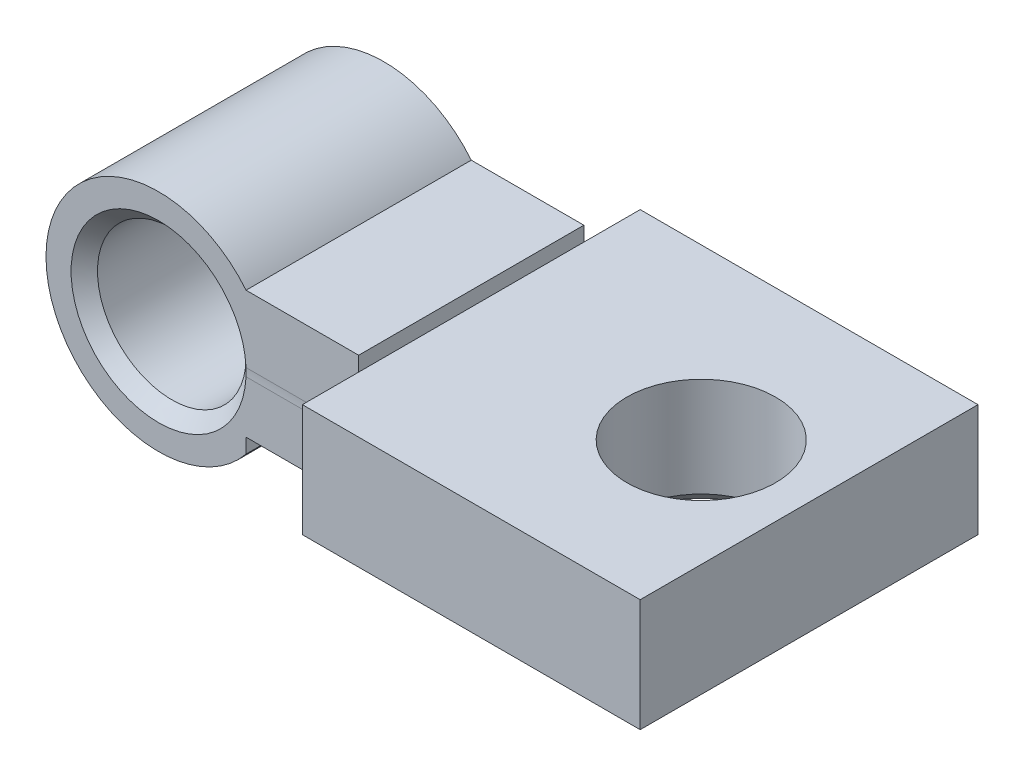
ISO-10303-21;
HEADER;
FILE_DESCRIPTION(('STEP AP214'),'2;1');
FILE_NAME('part.step','',(''),(''),'','','');
FILE_SCHEMA(('AUTOMOTIVE_DESIGN { 1 0 10303 214 1 1 1 1 }'));
ENDSEC;
DATA;
#1=APPLICATION_CONTEXT('core data for automotive mechanical design processes');
#2=APPLICATION_PROTOCOL_DEFINITION('international standard','automotive_design',2000,#1);
#3=PRODUCT_CONTEXT('',#1,'mechanical');
#4=PRODUCT('Part','Part','',(#3));
#5=PRODUCT_RELATED_PRODUCT_CATEGORY('part','',(#4));
#6=PRODUCT_DEFINITION_FORMATION('','',#4);
#7=PRODUCT_DEFINITION_CONTEXT('part definition',#1,'design');
#8=PRODUCT_DEFINITION('design','',#6,#7);
#9=PRODUCT_DEFINITION_SHAPE('','',#8);
#10=(LENGTH_UNIT() NAMED_UNIT(*) SI_UNIT(.MILLI.,.METRE.));
#11=(NAMED_UNIT(*) PLANE_ANGLE_UNIT() SI_UNIT($,.RADIAN.));
#12=(NAMED_UNIT(*) SI_UNIT($,.STERADIAN.) SOLID_ANGLE_UNIT());
#13=UNCERTAINTY_MEASURE_WITH_UNIT(LENGTH_MEASURE(1.E-05),#10,'distance_accuracy_value','');
#14=(GEOMETRIC_REPRESENTATION_CONTEXT(3) GLOBAL_UNCERTAINTY_ASSIGNED_CONTEXT((#13)) GLOBAL_UNIT_ASSIGNED_CONTEXT((#10,
#11,#12)) REPRESENTATION_CONTEXT('',''));
#15=CARTESIAN_POINT('',(0.,0.,0.));
#16=DIRECTION('',(0.,0.,1.));
#17=DIRECTION('',(1.,0.,0.));
#18=AXIS2_PLACEMENT_3D('',#15,#16,#17);
#19=CARTESIAN_POINT('',(3.88246984652232,-6.09266151445271,0.));
#20=DIRECTION('',(-1.,0.,0.));
#21=DIRECTION('',(0.,0.,1.));
#22=AXIS2_PLACEMENT_3D('',#19,#20,#21);
#23=PLANE('',#22);
#24=DIRECTION('',(0.,0.,-1.));
#25=VECTOR('',#24,1.);
#26=CARTESIAN_POINT('',(3.88246984652232,-2.5,0.));
#27=LINE('',#26,#25);
#28=CARTESIAN_POINT('',(3.88246984652232,-2.5,10.));
#29=VERTEX_POINT('',#28);
#30=CARTESIAN_POINT('',(3.88246984652232,-2.5,0.));
#31=VERTEX_POINT('',#30);
#32=EDGE_CURVE('E68',#29,#31,#27,.T.);
#33=ORIENTED_EDGE('',*,*,#32,.F.);
#34=DIRECTION('',(0.,-1.,0.));
#35=VECTOR('',#34,1.);
#36=CARTESIAN_POINT('',(3.88246984652232,-6.09266151445271,10.));
#37=LINE('',#36,#35);
#38=CARTESIAN_POINT('',(3.88246984652232,-3.1506234130478,10.));
#39=VERTEX_POINT('',#38);
#40=EDGE_CURVE('E251',#29,#39,#37,.T.);
#41=ORIENTED_EDGE('',*,*,#40,.T.);
#42=DIRECTION('',(0.,0.,-1.));
#43=VECTOR('',#42,1.);
#44=CARTESIAN_POINT('',(3.88246984652232,-3.1506234130478,10.));
#45=LINE('',#44,#43);
#46=CARTESIAN_POINT('',(3.88246984652232,-3.1506234130478,0.));
#47=VERTEX_POINT('',#46);
#48=EDGE_CURVE('E287',#47,#39,#45,.F.);
#49=ORIENTED_EDGE('',*,*,#48,.F.);
#50=DIRECTION('',(0.,-1.,0.));
#51=VECTOR('',#50,1.);
#52=CARTESIAN_POINT('',(3.88246984652232,-6.09266151445271,0.));
#53=LINE('',#52,#51);
#54=EDGE_CURVE('E274',#31,#47,#53,.T.);
#55=ORIENTED_EDGE('',*,*,#54,.F.);
#56=EDGE_LOOP('',(#33,#41,#49,#55));
#57=FACE_BOUND('',#56,.T.);
#58=ADVANCED_FACE('F42',(#57),#23,.F.);
#59=CARTESIAN_POINT('',(0.,0.,10.));
#60=DIRECTION('',(0.,0.,-1.));
#61=DIRECTION('',(-1.,0.,0.));
#62=AXIS2_PLACEMENT_3D('',#59,#60,#61);
#63=CYLINDRICAL_SURFACE('',#62,5.);
#64=CARTESIAN_POINT('',(0.,0.,0.));
#65=DIRECTION('',(0.,0.,1.));
#66=DIRECTION('',(1.,0.,0.));
#67=AXIS2_PLACEMENT_3D('',#64,#65,#66);
#68=CIRCLE('',#67,5.);
#69=CARTESIAN_POINT('',(3.88246984652232,3.1506234130478,0.));
#70=VERTEX_POINT('',#69);
#71=EDGE_CURVE('E301',#70,#47,#68,.T.);
#72=ORIENTED_EDGE('',*,*,#71,.T.);
#73=ORIENTED_EDGE('',*,*,#48,.T.);
#74=CARTESIAN_POINT('',(0.,0.,10.));
#75=DIRECTION('',(0.,0.,1.));
#76=DIRECTION('',(1.,0.,0.));
#77=AXIS2_PLACEMENT_3D('',#74,#75,#76);
#78=CIRCLE('',#77,5.);
#79=CARTESIAN_POINT('',(3.88246984652232,3.1506234130478,10.));
#80=VERTEX_POINT('',#79);
#81=EDGE_CURVE('E52',#80,#39,#78,.T.);
#82=ORIENTED_EDGE('',*,*,#81,.F.);
#83=DIRECTION('',(0.,0.,1.));
#84=VECTOR('',#83,1.);
#85=CARTESIAN_POINT('',(3.88246984652232,3.1506234130478,0.));
#86=LINE('',#85,#84);
#87=EDGE_CURVE('E283',#70,#80,#86,.T.);
#88=ORIENTED_EDGE('',*,*,#87,.F.);
#89=EDGE_LOOP('',(#72,#73,#82,#88));
#90=FACE_BOUND('',#89,.T.);
#91=ADVANCED_FACE('F44',(#90),#63,.T.);
#92=CARTESIAN_POINT('',(0.,0.,10.));
#93=DIRECTION('',(0.,0.,1.));
#94=DIRECTION('',(1.,0.,0.));
#95=AXIS2_PLACEMENT_3D('',#92,#93,#94);
#96=PLANE('',#95);
#97=CARTESIAN_POINT('',(0.,0.,10.));
#98=DIRECTION('',(0.,0.,1.));
#99=DIRECTION('',(1.,0.,0.));
#100=AXIS2_PLACEMENT_3D('',#97,#98,#99);
#101=CIRCLE('',#100,3.8865);
#102=CARTESIAN_POINT('',(3.88246984652232,0.176946717530785,10.));
#103=VERTEX_POINT('',#102);
#104=CARTESIAN_POINT('',(3.88246984652232,-0.176946717530785,10.));
#105=VERTEX_POINT('',#104);
#106=EDGE_CURVE('E297',#103,#105,#101,.T.);
#107=ORIENTED_EDGE('',*,*,#106,.F.);
#108=DIRECTION('',(-1.,0.,0.));
#109=VECTOR('',#108,1.);
#110=CARTESIAN_POINT('',(8.88246984652232,0.176946717530788,9.99999999999999));
#111=LINE('',#110,#109);
#112=CARTESIAN_POINT('',(8.88246984652232,0.176946717530788,9.99999999999999));
#113=VERTEX_POINT('',#112);
#114=EDGE_CURVE('E247',#113,#103,#111,.T.);
#115=ORIENTED_EDGE('',*,*,#114,.F.);
#116=DIRECTION('',(0.,-1.,0.));
#117=VECTOR('',#116,1.);
#118=CARTESIAN_POINT('',(8.88246984652232,0.,10.));
#119=LINE('',#118,#117);
#120=CARTESIAN_POINT('',(8.88246984652232,2.5,10.));
#121=VERTEX_POINT('',#120);
#122=EDGE_CURVE('E264',#121,#113,#119,.T.);
#123=ORIENTED_EDGE('',*,*,#122,.F.);
#124=CARTESIAN_POINT('',(8.88246984652232,3.1506234130478,10.));
#125=VERTEX_POINT('',#124);
#126=EDGE_CURVE('E256',#125,#121,#119,.T.);
#127=ORIENTED_EDGE('',*,*,#126,.F.);
#128=DIRECTION('',(-1.,0.,0.));
#129=VECTOR('',#128,1.);
#130=CARTESIAN_POINT('',(8.88246984652232,3.1506234130478,10.));
#131=LINE('',#130,#129);
#132=EDGE_CURVE('E242',#125,#80,#131,.T.);
#133=ORIENTED_EDGE('',*,*,#132,.T.);
#134=ORIENTED_EDGE('',*,*,#81,.T.);
#135=ORIENTED_EDGE('',*,*,#40,.F.);
#136=DIRECTION('',(-1.,0.,0.));
#137=VECTOR('',#136,1.);
#138=CARTESIAN_POINT('',(8.88246984652232,-2.5,10.));
#139=LINE('',#138,#137);
#140=CARTESIAN_POINT('',(8.88246984652232,-2.5,10.));
#141=VERTEX_POINT('',#140);
#142=EDGE_CURVE('E236',#141,#29,#139,.T.);
#143=ORIENTED_EDGE('',*,*,#142,.F.);
#144=DIRECTION('',(0.,-1.,0.));
#145=VECTOR('',#144,1.);
#146=CARTESIAN_POINT('',(8.88246984652232,0.,10.));
#147=LINE('',#146,#145);
#148=CARTESIAN_POINT('',(8.88246984652232,-0.176946717530786,10.));
#149=VERTEX_POINT('',#148);
#150=EDGE_CURVE('E237',#149,#141,#147,.T.);
#151=ORIENTED_EDGE('',*,*,#150,.F.);
#152=DIRECTION('',(-1.,0.,0.));
#153=VECTOR('',#152,1.);
#154=CARTESIAN_POINT('',(8.88246984652232,-0.176946717530786,10.));
#155=LINE('',#154,#153);
#156=EDGE_CURVE('E241',#149,#105,#155,.T.);
#157=ORIENTED_EDGE('',*,*,#156,.T.);
#158=EDGE_LOOP('',(#107,#115,#123,#127,#133,#134,#135,#143,#151,#157));
#159=FACE_BOUND('',#158,.T.);
#160=ADVANCED_FACE('F319',(#159),#96,.T.);
#161=CARTESIAN_POINT('',(0.,0.,0.));
#162=DIRECTION('',(0.,0.,1.));
#163=DIRECTION('',(1.,0.,0.));
#164=AXIS2_PLACEMENT_3D('',#161,#162,#163);
#165=PLANE('',#164);
#166=CARTESIAN_POINT('',(0.,0.,0.));
#167=DIRECTION('',(0.,0.,1.));
#168=DIRECTION('',(1.,0.,0.));
#169=AXIS2_PLACEMENT_3D('',#166,#167,#168);
#170=CIRCLE('',#169,3.29999999999999);
#171=CARTESIAN_POINT('',(3.29999999999999,0.,0.));
#172=VERTEX_POINT('',#171);
#173=EDGE_CURVE('E296',#172,#172,#170,.T.);
#174=ORIENTED_EDGE('',*,*,#173,.T.);
#175=EDGE_LOOP('',(#174));
#176=FACE_BOUND('',#175,.T.);
#177=ORIENTED_EDGE('',*,*,#71,.F.);
#178=DIRECTION('',(-1.,0.,0.));
#179=VECTOR('',#178,1.);
#180=CARTESIAN_POINT('',(8.88246984652232,3.1506234130478,0.));
#181=LINE('',#180,#179);
#182=CARTESIAN_POINT('',(8.88246984652232,3.1506234130478,0.));
#183=VERTEX_POINT('',#182);
#184=EDGE_CURVE('E246',#183,#70,#181,.T.);
#185=ORIENTED_EDGE('',*,*,#184,.F.);
#186=DIRECTION('',(0.,1.,0.));
#187=VECTOR('',#186,1.);
#188=CARTESIAN_POINT('',(8.88246984652232,0.,0.));
#189=LINE('',#188,#187);
#190=CARTESIAN_POINT('',(8.88246984652232,2.5,0.));
#191=VERTEX_POINT('',#190);
#192=EDGE_CURVE('E166',#191,#183,#189,.T.);
#193=ORIENTED_EDGE('',*,*,#192,.F.);
#194=CARTESIAN_POINT('',(8.88246984652232,-2.5,0.));
#195=VERTEX_POINT('',#194);
#196=EDGE_CURVE('E183',#195,#191,#189,.T.);
#197=ORIENTED_EDGE('',*,*,#196,.F.);
#198=DIRECTION('',(-1.,0.,0.));
#199=VECTOR('',#198,1.);
#200=CARTESIAN_POINT('',(8.88246984652232,-2.5,0.));
#201=LINE('',#200,#199);
#202=EDGE_CURVE('E232',#195,#31,#201,.T.);
#203=ORIENTED_EDGE('',*,*,#202,.T.);
#204=ORIENTED_EDGE('',*,*,#54,.T.);
#205=EDGE_LOOP('',(#177,#185,#193,#197,#203,#204));
#206=FACE_BOUND('',#205,.T.);
#207=ADVANCED_FACE('F354',(#176,#206),#165,.F.);
#208=CARTESIAN_POINT('',(0.,0.,10.));
#209=DIRECTION('',(0.,0.,1.));
#210=DIRECTION('',(1.,0.,0.));
#211=AXIS2_PLACEMENT_3D('',#208,#209,#210);
#212=CYLINDRICAL_SURFACE('',#211,3.29999999999999);
#213=CARTESIAN_POINT('',(0.,0.,9.41349999999998));
#214=DIRECTION('',(0.,0.,1.));
#215=DIRECTION('',(1.,0.,0.));
#216=AXIS2_PLACEMENT_3D('',#213,#214,#215);
#217=CIRCLE('',#216,3.29999999999999);
#218=CARTESIAN_POINT('',(3.29999999999999,0.,9.41349999999998));
#219=VERTEX_POINT('',#218);
#220=EDGE_CURVE('E292',#219,#219,#217,.T.);
#221=ORIENTED_EDGE('',*,*,#220,.T.);
#222=EDGE_LOOP('',(#221));
#223=FACE_BOUND('',#222,.T.);
#224=ORIENTED_EDGE('',*,*,#173,.F.);
#225=EDGE_LOOP('',(#224));
#226=FACE_BOUND('',#225,.T.);
#227=ADVANCED_FACE('F406',(#223,#226),#212,.F.);
#228=CARTESIAN_POINT('',(0.,0.,10.));
#229=DIRECTION('',(0.,0.,1.));
#230=DIRECTION('',(1.,0.,0.));
#231=AXIS2_PLACEMENT_3D('',#228,#229,#230);
#232=CONICAL_SURFACE('',#231,3.8865,0.785398163397441);
#233=ORIENTED_EDGE('',*,*,#220,.F.);
#234=EDGE_LOOP('',(#233));
#235=FACE_BOUND('',#234,.T.);
#236=ORIENTED_EDGE('',*,*,#106,.T.);
#237=CARTESIAN_POINT('',(3.88246984652232,0.176946717530788,9.99999999999999));
#238=CARTESIAN_POINT('',(3.88246984652232,0.,9.99194387216134));
#239=CARTESIAN_POINT('',(3.88246984652232,-0.176946717530786,9.99999999999999));
#240=B_SPLINE_CURVE_WITH_KNOTS('',2,(#237,#238,#239),.UNSPECIFIED.,.F.,.F.,(3,3),(0.,1.),.UNSPECIFIED.);
#241=EDGE_CURVE('E291',#105,#103,#240,.F.);
#242=ORIENTED_EDGE('',*,*,#241,.T.);
#243=EDGE_LOOP('',(#236,#242));
#244=FACE_BOUND('',#243,.T.);
#245=ADVANCED_FACE('F314',(#235,#244),#232,.F.);
#246=CARTESIAN_POINT('',(8.88246984652232,3.1506234130478,0.));
#247=DIRECTION('',(0.,-1.,0.));
#248=DIRECTION('',(0.,0.,-1.));
#249=AXIS2_PLACEMENT_3D('',#246,#247,#248);
#250=PLANE('',#249);
#251=ORIENTED_EDGE('',*,*,#87,.T.);
#252=ORIENTED_EDGE('',*,*,#132,.F.);
#253=DIRECTION('',(0.,0.,1.));
#254=VECTOR('',#253,1.);
#255=CARTESIAN_POINT('',(8.88246984652232,3.1506234130478,0.));
#256=LINE('',#255,#254);
#257=EDGE_CURVE('E227',#183,#125,#256,.T.);
#258=ORIENTED_EDGE('',*,*,#257,.F.);
#259=ORIENTED_EDGE('',*,*,#184,.T.);
#260=EDGE_LOOP('',(#251,#252,#258,#259));
#261=FACE_BOUND('',#260,.T.);
#262=ADVANCED_FACE('F219',(#261),#250,.F.);
#263=CARTESIAN_POINT('',(8.88246984652232,0.176946717530788,9.99999999999999));
#264=CARTESIAN_POINT('',(8.88246984652232,0.,9.99194387216134));
#265=CARTESIAN_POINT('',(8.88246984652232,-0.176946717530786,9.99999999999999));
#266=B_SPLINE_CURVE_WITH_KNOTS('',2,(#263,#264,#265),.UNSPECIFIED.,.F.,.F.,(3,3),(0.,1.),.UNSPECIFIED.);
#267=DIRECTION('',(-1.,0.,0.));
#268=VECTOR('',#267,1.);
#269=SURFACE_OF_LINEAR_EXTRUSION('',#266,#268);
#270=ORIENTED_EDGE('',*,*,#241,.F.);
#271=ORIENTED_EDGE('',*,*,#156,.F.);
#272=CARTESIAN_POINT('',(8.88246984652232,-0.176946717530786,9.99999999999999));
#273=CARTESIAN_POINT('',(8.88246984652232,0.,9.99194387216134));
#274=CARTESIAN_POINT('',(8.88246984652232,0.176946717530788,9.99999999999999));
#275=B_SPLINE_CURVE_WITH_KNOTS('',2,(#272,#273,#274),.UNSPECIFIED.,.F.,.F.,(3,3),(0.,1.),.UNSPECIFIED.);
#276=EDGE_CURVE('E178',#113,#149,#275,.F.);
#277=ORIENTED_EDGE('',*,*,#276,.F.);
#278=ORIENTED_EDGE('',*,*,#114,.T.);
#279=EDGE_LOOP('',(#270,#271,#277,#278));
#280=FACE_BOUND('',#279,.T.);
#281=ADVANCED_FACE('F213',(#280),#269,.F.);
#282=CARTESIAN_POINT('',(8.88246984652232,-2.5,0.));
#283=DIRECTION('',(0.,1.,0.));
#284=DIRECTION('',(0.,0.,1.));
#285=AXIS2_PLACEMENT_3D('',#282,#283,#284);
#286=PLANE('',#285);
#287=CARTESIAN_POINT('',(19.0931454608073,-2.5,5.));
#288=DIRECTION('',(0.,-1.,0.));
#289=DIRECTION('',(0.,0.,-1.));
#290=AXIS2_PLACEMENT_3D('',#287,#288,#289);
#291=CIRCLE('',#290,3.8865);
#292=CARTESIAN_POINT('',(19.0931454608073,-2.5,1.1135));
#293=VERTEX_POINT('',#292);
#294=EDGE_CURVE('E385',#293,#293,#291,.T.);
#295=ORIENTED_EDGE('',*,*,#294,.F.);
#296=EDGE_LOOP('',(#295));
#297=FACE_BOUND('',#296,.T.);
#298=ORIENTED_EDGE('',*,*,#32,.T.);
#299=ORIENTED_EDGE('',*,*,#202,.F.);
#300=DIRECTION('',(0.,0.,-1.));
#301=VECTOR('',#300,1.);
#302=CARTESIAN_POINT('',(8.88246984652232,-2.5,12.5));
#303=LINE('',#302,#301);
#304=CARTESIAN_POINT('',(8.88246984652232,-2.5,-2.5));
#305=VERTEX_POINT('',#304);
#306=EDGE_CURVE('E364',#195,#305,#303,.T.);
#307=ORIENTED_EDGE('',*,*,#306,.T.);
#308=DIRECTION('',(-1.,0.,0.));
#309=VECTOR('',#308,1.);
#310=CARTESIAN_POINT('',(23.8824698465223,-2.5,-2.5));
#311=LINE('',#310,#309);
#312=CARTESIAN_POINT('',(23.8824698465223,-2.5,-2.5));
#313=VERTEX_POINT('',#312);
#314=EDGE_CURVE('E371',#313,#305,#311,.T.);
#315=ORIENTED_EDGE('',*,*,#314,.F.);
#316=DIRECTION('',(0.,0.,-1.));
#317=VECTOR('',#316,1.);
#318=CARTESIAN_POINT('',(23.8824698465223,-2.5,12.5));
#319=LINE('',#318,#317);
#320=CARTESIAN_POINT('',(23.8824698465223,-2.5,12.5));
#321=VERTEX_POINT('',#320);
#322=EDGE_CURVE('E152',#321,#313,#319,.T.);
#323=ORIENTED_EDGE('',*,*,#322,.F.);
#324=DIRECTION('',(-1.,0.,0.));
#325=VECTOR('',#324,1.);
#326=CARTESIAN_POINT('',(23.8824698465223,-2.5,12.5));
#327=LINE('',#326,#325);
#328=CARTESIAN_POINT('',(8.88246984652232,-2.5,12.5));
#329=VERTEX_POINT('',#328);
#330=EDGE_CURVE('E168',#321,#329,#327,.T.);
#331=ORIENTED_EDGE('',*,*,#330,.T.);
#332=EDGE_CURVE('E157',#329,#141,#303,.T.);
#333=ORIENTED_EDGE('',*,*,#332,.T.);
#334=ORIENTED_EDGE('',*,*,#142,.T.);
#335=EDGE_LOOP('',(#298,#299,#307,#315,#323,#331,#333,#334));
#336=FACE_BOUND('',#335,.T.);
#337=ADVANCED_FACE('F210',(#297,#336),#286,.F.);
#338=CARTESIAN_POINT('',(8.88246984652232,0.,0.));
#339=DIRECTION('',(1.,0.,0.));
#340=DIRECTION('',(0.,0.,-1.));
#341=AXIS2_PLACEMENT_3D('',#338,#339,#340);
#342=PLANE('',#341);
#343=DIRECTION('',(0.,0.,1.));
#344=VECTOR('',#343,1.);
#345=CARTESIAN_POINT('',(8.88246984652232,2.5,12.5));
#346=LINE('',#345,#344);
#347=EDGE_CURVE('E11',#191,#121,#346,.T.);
#348=ORIENTED_EDGE('',*,*,#347,.F.);
#349=ORIENTED_EDGE('',*,*,#192,.T.);
#350=ORIENTED_EDGE('',*,*,#257,.T.);
#351=ORIENTED_EDGE('',*,*,#126,.T.);
#352=EDGE_LOOP('',(#348,#349,#350,#351));
#353=FACE_BOUND('',#352,.T.);
#354=ADVANCED_FACE('F207',(#353),#342,.T.);
#355=CARTESIAN_POINT('',(8.88246984652232,0.,0.));
#356=DIRECTION('',(-1.,0.,0.));
#357=DIRECTION('',(0.,0.,1.));
#358=AXIS2_PLACEMENT_3D('',#355,#356,#357);
#359=PLANE('',#358);
#360=ORIENTED_EDGE('',*,*,#306,.F.);
#361=ORIENTED_EDGE('',*,*,#196,.T.);
#362=CARTESIAN_POINT('',(8.88246984652232,2.5,-2.5));
#363=VERTEX_POINT('',#362);
#364=EDGE_CURVE('E54',#363,#191,#346,.T.);
#365=ORIENTED_EDGE('',*,*,#364,.F.);
#366=DIRECTION('',(0.,1.,0.));
#367=VECTOR('',#366,1.);
#368=CARTESIAN_POINT('',(8.88246984652232,-2.5,-2.5));
#369=LINE('',#368,#367);
#370=EDGE_CURVE('E161',#305,#363,#369,.T.);
#371=ORIENTED_EDGE('',*,*,#370,.F.);
#372=EDGE_LOOP('',(#360,#361,#365,#371));
#373=FACE_BOUND('',#372,.T.);
#374=ADVANCED_FACE('F196',(#373),#359,.T.);
#375=CARTESIAN_POINT('',(23.8824698465223,-2.5,-2.5));
#376=DIRECTION('',(0.,0.,1.));
#377=DIRECTION('',(1.,0.,0.));
#378=AXIS2_PLACEMENT_3D('',#375,#376,#377);
#379=PLANE('',#378);
#380=ORIENTED_EDGE('',*,*,#370,.T.);
#381=DIRECTION('',(-1.,0.,0.));
#382=VECTOR('',#381,1.);
#383=CARTESIAN_POINT('',(23.8824698465223,2.5,-2.5));
#384=LINE('',#383,#382);
#385=CARTESIAN_POINT('',(23.8824698465223,2.5,-2.5));
#386=VERTEX_POINT('',#385);
#387=EDGE_CURVE('E139',#386,#363,#384,.T.);
#388=ORIENTED_EDGE('',*,*,#387,.F.);
#389=DIRECTION('',(0.,1.,0.));
#390=VECTOR('',#389,1.);
#391=CARTESIAN_POINT('',(23.8824698465223,-2.5,-2.5));
#392=LINE('',#391,#390);
#393=EDGE_CURVE('E147',#313,#386,#392,.T.);
#394=ORIENTED_EDGE('',*,*,#393,.F.);
#395=ORIENTED_EDGE('',*,*,#314,.T.);
#396=EDGE_LOOP('',(#380,#388,#394,#395));
#397=FACE_BOUND('',#396,.T.);
#398=ADVANCED_FACE('F159',(#397),#379,.F.);
#399=CARTESIAN_POINT('',(23.8824698465223,2.5,12.5));
#400=DIRECTION('',(0.,-1.,0.));
#401=DIRECTION('',(0.,0.,-1.));
#402=AXIS2_PLACEMENT_3D('',#399,#400,#401);
#403=PLANE('',#402);
#404=CARTESIAN_POINT('',(19.0931454608073,2.5,5.));
#405=DIRECTION('',(0.,-1.,0.));
#406=DIRECTION('',(0.,0.,-1.));
#407=AXIS2_PLACEMENT_3D('',#404,#405,#406);
#408=CIRCLE('',#407,3.29999999999998);
#409=CARTESIAN_POINT('',(19.0931454608073,2.5,1.70000000000002));
#410=VERTEX_POINT('',#409);
#411=EDGE_CURVE('E46',#410,#410,#408,.T.);
#412=ORIENTED_EDGE('',*,*,#411,.T.);
#413=EDGE_LOOP('',(#412));
#414=FACE_BOUND('',#413,.T.);
#415=ORIENTED_EDGE('',*,*,#364,.T.);
#416=ORIENTED_EDGE('',*,*,#347,.T.);
#417=CARTESIAN_POINT('',(8.88246984652232,2.5,12.5));
#418=VERTEX_POINT('',#417);
#419=EDGE_CURVE('E55',#121,#418,#346,.T.);
#420=ORIENTED_EDGE('',*,*,#419,.T.);
#421=DIRECTION('',(-1.,0.,0.));
#422=VECTOR('',#421,1.);
#423=CARTESIAN_POINT('',(23.8824698465223,2.5,12.5));
#424=LINE('',#423,#422);
#425=CARTESIAN_POINT('',(23.8824698465223,2.5,12.5));
#426=VERTEX_POINT('',#425);
#427=EDGE_CURVE('E142',#426,#418,#424,.T.);
#428=ORIENTED_EDGE('',*,*,#427,.F.);
#429=DIRECTION('',(0.,0.,1.));
#430=VECTOR('',#429,1.);
#431=CARTESIAN_POINT('',(23.8824698465223,2.5,12.5));
#432=LINE('',#431,#430);
#433=EDGE_CURVE('E134',#386,#426,#432,.T.);
#434=ORIENTED_EDGE('',*,*,#433,.F.);
#435=ORIENTED_EDGE('',*,*,#387,.T.);
#436=EDGE_LOOP('',(#415,#416,#420,#428,#434,#435));
#437=FACE_BOUND('',#436,.T.);
#438=ADVANCED_FACE('F137',(#414,#437),#403,.F.);
#439=CARTESIAN_POINT('',(23.8824698465223,-2.5,12.5));
#440=DIRECTION('',(0.,0.,-1.));
#441=DIRECTION('',(-1.,0.,0.));
#442=AXIS2_PLACEMENT_3D('',#439,#440,#441);
#443=PLANE('',#442);
#444=DIRECTION('',(0.,-1.,0.));
#445=VECTOR('',#444,1.);
#446=CARTESIAN_POINT('',(8.88246984652232,-2.5,12.5));
#447=LINE('',#446,#445);
#448=EDGE_CURVE('E359',#418,#329,#447,.T.);
#449=ORIENTED_EDGE('',*,*,#448,.T.);
#450=ORIENTED_EDGE('',*,*,#330,.F.);
#451=DIRECTION('',(0.,-1.,0.));
#452=VECTOR('',#451,1.);
#453=CARTESIAN_POINT('',(23.8824698465223,-2.5,12.5));
#454=LINE('',#453,#452);
#455=EDGE_CURVE('E146',#426,#321,#454,.T.);
#456=ORIENTED_EDGE('',*,*,#455,.F.);
#457=ORIENTED_EDGE('',*,*,#427,.T.);
#458=EDGE_LOOP('',(#449,#450,#456,#457));
#459=FACE_BOUND('',#458,.T.);
#460=ADVANCED_FACE('F198',(#459),#443,.F.);
#461=CARTESIAN_POINT('',(23.8824698465223,0.,0.));
#462=DIRECTION('',(-1.,0.,0.));
#463=DIRECTION('',(0.,0.,1.));
#464=AXIS2_PLACEMENT_3D('',#461,#462,#463);
#465=PLANE('',#464);
#466=ORIENTED_EDGE('',*,*,#393,.T.);
#467=ORIENTED_EDGE('',*,*,#433,.T.);
#468=ORIENTED_EDGE('',*,*,#455,.T.);
#469=ORIENTED_EDGE('',*,*,#322,.T.);
#470=EDGE_LOOP('',(#466,#467,#468,#469));
#471=FACE_BOUND('',#470,.T.);
#472=ADVANCED_FACE('F150',(#471),#465,.F.);
#473=ORIENTED_EDGE('',*,*,#419,.F.);
#474=ORIENTED_EDGE('',*,*,#122,.T.);
#475=ORIENTED_EDGE('',*,*,#276,.T.);
#476=ORIENTED_EDGE('',*,*,#150,.T.);
#477=ORIENTED_EDGE('',*,*,#332,.F.);
#478=ORIENTED_EDGE('',*,*,#448,.F.);
#479=EDGE_LOOP('',(#473,#474,#475,#476,#477,#478));
#480=FACE_BOUND('',#479,.T.);
#481=ADVANCED_FACE('F185',(#480),#359,.T.);
#482=CARTESIAN_POINT('',(19.0931454608073,-2.5,5.));
#483=DIRECTION('',(0.,-1.,0.));
#484=DIRECTION('',(0.,0.,-1.));
#485=AXIS2_PLACEMENT_3D('',#482,#483,#484);
#486=CYLINDRICAL_SURFACE('',#485,3.29999999999998);
#487=CARTESIAN_POINT('',(19.0931454608073,-1.91349999999998,5.));
#488=DIRECTION('',(0.,-1.,0.));
#489=DIRECTION('',(0.,0.,-1.));
#490=AXIS2_PLACEMENT_3D('',#487,#488,#489);
#491=CIRCLE('',#490,3.29999999999999);
#492=CARTESIAN_POINT('',(19.0931454608073,-1.91349999999998,1.70000000000001));
#493=VERTEX_POINT('',#492);
#494=EDGE_CURVE('E381',#493,#493,#491,.T.);
#495=ORIENTED_EDGE('',*,*,#494,.T.);
#496=EDGE_LOOP('',(#495));
#497=FACE_BOUND('',#496,.T.);
#498=ORIENTED_EDGE('',*,*,#411,.F.);
#499=EDGE_LOOP('',(#498));
#500=FACE_BOUND('',#499,.T.);
#501=ADVANCED_FACE('F195',(#497,#500),#486,.F.);
#502=CARTESIAN_POINT('',(19.0931454608073,-2.5,5.));
#503=DIRECTION('',(0.,-1.,0.));
#504=DIRECTION('',(0.,0.,-1.));
#505=AXIS2_PLACEMENT_3D('',#502,#503,#504);
#506=CONICAL_SURFACE('',#505,3.8865,0.785398163397441);
#507=ORIENTED_EDGE('',*,*,#494,.F.);
#508=EDGE_LOOP('',(#507));
#509=FACE_BOUND('',#508,.T.);
#510=ORIENTED_EDGE('',*,*,#294,.T.);
#511=EDGE_LOOP('',(#510));
#512=FACE_BOUND('',#511,.T.);
#513=ADVANCED_FACE('F390',(#509,#512),#506,.F.);
#514=CLOSED_SHELL('',(#58,#91,#160,#207,#227,#245,#262,#281,#337,#354,#374,#398,#438,#460,#472,
#481,#501,#513));
#515=MANIFOLD_SOLID_BREP('B2',#514);
#516=ADVANCED_BREP_SHAPE_REPRESENTATION('',(#18,#515),#14);
#517=SHAPE_DEFINITION_REPRESENTATION(#9,#516);
ENDSEC;
END-ISO-10303-21;
